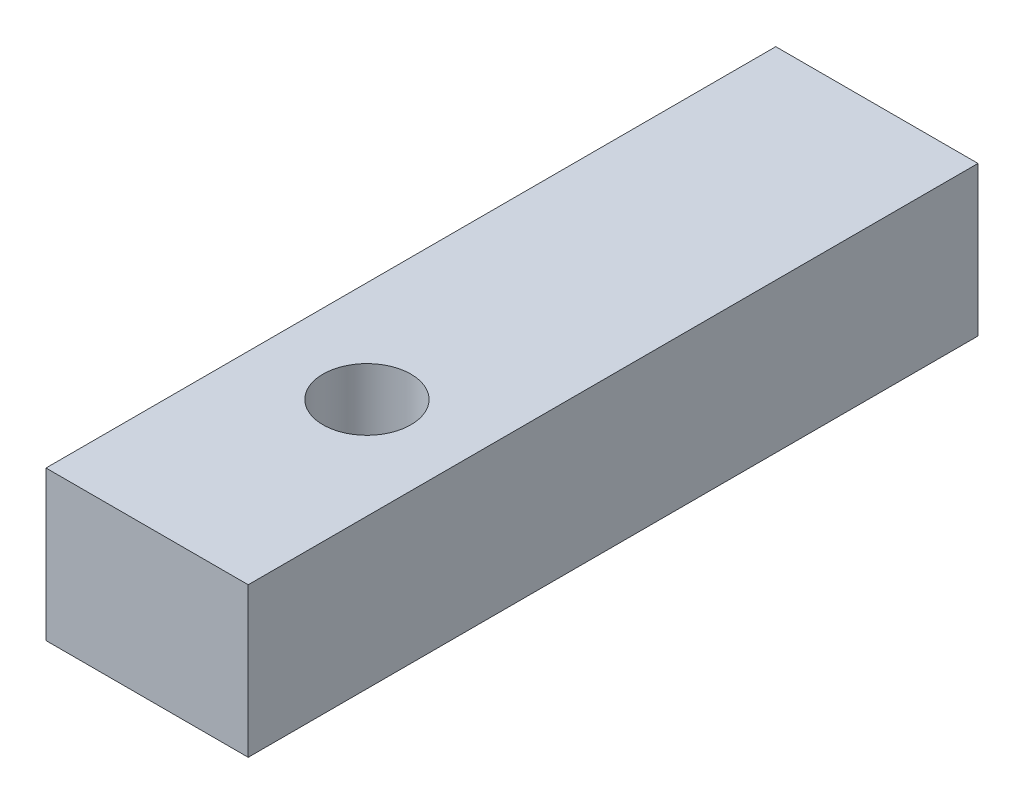
ISO-10303-21;
HEADER;
FILE_DESCRIPTION(('STEP AP214'),'2;1');
FILE_NAME('part.step','',(''),(''),'','','');
FILE_SCHEMA(('AUTOMOTIVE_DESIGN { 1 0 10303 214 1 1 1 1 }'));
ENDSEC;
DATA;
#1=APPLICATION_CONTEXT('core data for automotive mechanical design processes');
#2=APPLICATION_PROTOCOL_DEFINITION('international standard','automotive_design',2000,#1);
#3=PRODUCT_CONTEXT('',#1,'mechanical');
#4=PRODUCT('Part','Part','',(#3));
#5=PRODUCT_RELATED_PRODUCT_CATEGORY('part','',(#4));
#6=PRODUCT_DEFINITION_FORMATION('','',#4);
#7=PRODUCT_DEFINITION_CONTEXT('part definition',#1,'design');
#8=PRODUCT_DEFINITION('design','',#6,#7);
#9=PRODUCT_DEFINITION_SHAPE('','',#8);
#10=(LENGTH_UNIT() NAMED_UNIT(*) SI_UNIT(.MILLI.,.METRE.));
#11=(NAMED_UNIT(*) PLANE_ANGLE_UNIT() SI_UNIT($,.RADIAN.));
#12=(NAMED_UNIT(*) SI_UNIT($,.STERADIAN.) SOLID_ANGLE_UNIT());
#13=UNCERTAINTY_MEASURE_WITH_UNIT(LENGTH_MEASURE(1.E-05),#10,'distance_accuracy_value','');
#14=(GEOMETRIC_REPRESENTATION_CONTEXT(3) GLOBAL_UNCERTAINTY_ASSIGNED_CONTEXT((#13)) GLOBAL_UNIT_ASSIGNED_CONTEXT((#10,
#11,#12)) REPRESENTATION_CONTEXT('',''));
#15=CARTESIAN_POINT('',(0.,0.,0.));
#16=DIRECTION('',(0.,0.,1.));
#17=DIRECTION('',(1.,0.,0.));
#18=AXIS2_PLACEMENT_3D('',#15,#16,#17);
#19=CARTESIAN_POINT('',(-9.37031473424691,-28.3971041858876,7.99875547561629));
#20=DIRECTION('',(0.,-1.,0.));
#21=DIRECTION('',(0.,0.,-1.));
#22=AXIS2_PLACEMENT_3D('',#19,#20,#21);
#23=PLANE('',#22);
#24=CARTESIAN_POINT('',(-40.4,-28.3971041858876,13.9987554756163));
#25=DIRECTION('',(0.,-1.,0.));
#26=DIRECTION('',(0.,0.,-1.));
#27=AXIS2_PLACEMENT_3D('',#24,#25,#26);
#28=CIRCLE('',#27,5.);
#29=CARTESIAN_POINT('',(-40.4,-28.3971041858876,8.9987554756163));
#30=VERTEX_POINT('',#29);
#31=EDGE_CURVE('E20',#30,#30,#28,.F.);
#32=ORIENTED_EDGE('',*,*,#31,.T.);
#33=EDGE_LOOP('',(#32));
#34=FACE_BOUND('',#33,.T.);
#35=DIRECTION('',(0.,0.,1.));
#36=VECTOR('',#35,1.);
#37=CARTESIAN_POINT('',(-28.9,-28.3971041858876,39.));
#38=LINE('',#37,#36);
#39=CARTESIAN_POINT('',(-28.9,-28.3971041858876,-44.));
#40=VERTEX_POINT('',#39);
#41=CARTESIAN_POINT('',(-28.9,-28.3971041858876,39.));
#42=VERTEX_POINT('',#41);
#43=EDGE_CURVE('E60',#40,#42,#38,.T.);
#44=ORIENTED_EDGE('',*,*,#43,.T.);
#45=DIRECTION('',(-1.,0.,0.));
#46=VECTOR('',#45,1.);
#47=CARTESIAN_POINT('',(-51.9,-28.3971041858876,39.));
#48=LINE('',#47,#46);
#49=CARTESIAN_POINT('',(-51.9,-28.3971041858876,39.));
#50=VERTEX_POINT('',#49);
#51=EDGE_CURVE('E78',#42,#50,#48,.T.);
#52=ORIENTED_EDGE('',*,*,#51,.T.);
#53=DIRECTION('',(0.,0.,-1.));
#54=VECTOR('',#53,1.);
#55=CARTESIAN_POINT('',(-51.9,-28.3971041858876,-44.));
#56=LINE('',#55,#54);
#57=CARTESIAN_POINT('',(-51.9,-28.3971041858876,-44.));
#58=VERTEX_POINT('',#57);
#59=EDGE_CURVE('E75',#50,#58,#56,.T.);
#60=ORIENTED_EDGE('',*,*,#59,.T.);
#61=DIRECTION('',(1.,0.,0.));
#62=VECTOR('',#61,1.);
#63=CARTESIAN_POINT('',(-28.9,-28.3971041858876,-44.));
#64=LINE('',#63,#62);
#65=EDGE_CURVE('E65',#58,#40,#64,.T.);
#66=ORIENTED_EDGE('',*,*,#65,.T.);
#67=EDGE_LOOP('',(#44,#52,#60,#66));
#68=FACE_BOUND('',#67,.T.);
#69=ADVANCED_FACE('F17',(#34,#68),#23,.T.);
#70=CARTESIAN_POINT('',(-51.9,-28.3971041858876,-44.));
#71=DIRECTION('',(1.,0.,0.));
#72=DIRECTION('',(0.,0.,-1.));
#73=AXIS2_PLACEMENT_3D('',#70,#71,#72);
#74=PLANE('',#73);
#75=DIRECTION('',(0.,0.,-1.));
#76=VECTOR('',#75,1.);
#77=CARTESIAN_POINT('',(-51.9,-11.3971041858876,7.99875547561629));
#78=LINE('',#77,#76);
#79=CARTESIAN_POINT('',(-51.9,-11.3971041858876,39.));
#80=VERTEX_POINT('',#79);
#81=CARTESIAN_POINT('',(-51.9,-11.3971041858876,-44.));
#82=VERTEX_POINT('',#81);
#83=EDGE_CURVE('E86',#80,#82,#78,.T.);
#84=ORIENTED_EDGE('',*,*,#83,.T.);
#85=DIRECTION('',(0.,1.,0.));
#86=VECTOR('',#85,1.);
#87=CARTESIAN_POINT('',(-51.9,-28.3971041858876,-44.));
#88=LINE('',#87,#86);
#89=EDGE_CURVE('E70',#82,#58,#88,.F.);
#90=ORIENTED_EDGE('',*,*,#89,.T.);
#91=ORIENTED_EDGE('',*,*,#59,.F.);
#92=DIRECTION('',(0.,1.,0.));
#93=VECTOR('',#92,1.);
#94=CARTESIAN_POINT('',(-51.9,-28.3971041858876,39.));
#95=LINE('',#94,#93);
#96=EDGE_CURVE('E98',#50,#80,#95,.T.);
#97=ORIENTED_EDGE('',*,*,#96,.T.);
#98=EDGE_LOOP('',(#84,#90,#91,#97));
#99=FACE_BOUND('',#98,.T.);
#100=ADVANCED_FACE('F85',(#99),#74,.F.);
#101=CARTESIAN_POINT('',(-28.9,-28.3971041858876,-44.));
#102=DIRECTION('',(0.,0.,1.));
#103=DIRECTION('',(1.,0.,0.));
#104=AXIS2_PLACEMENT_3D('',#101,#102,#103);
#105=PLANE('',#104);
#106=DIRECTION('',(1.,0.,0.));
#107=VECTOR('',#106,1.);
#108=CARTESIAN_POINT('',(-9.37031473424691,-11.3971041858876,-44.));
#109=LINE('',#108,#107);
#110=CARTESIAN_POINT('',(-28.9,-11.3971041858876,-44.));
#111=VERTEX_POINT('',#110);
#112=EDGE_CURVE('E105',#82,#111,#109,.T.);
#113=ORIENTED_EDGE('',*,*,#112,.T.);
#114=DIRECTION('',(0.,1.,0.));
#115=VECTOR('',#114,1.);
#116=CARTESIAN_POINT('',(-28.9,-28.3971041858876,-44.));
#117=LINE('',#116,#115);
#118=EDGE_CURVE('E72',#111,#40,#117,.F.);
#119=ORIENTED_EDGE('',*,*,#118,.T.);
#120=ORIENTED_EDGE('',*,*,#65,.F.);
#121=ORIENTED_EDGE('',*,*,#89,.F.);
#122=EDGE_LOOP('',(#113,#119,#120,#121));
#123=FACE_BOUND('',#122,.T.);
#124=ADVANCED_FACE('F68',(#123),#105,.F.);
#125=CARTESIAN_POINT('',(-28.9,-28.3971041858876,39.));
#126=DIRECTION('',(-1.,0.,0.));
#127=DIRECTION('',(0.,0.,1.));
#128=AXIS2_PLACEMENT_3D('',#125,#126,#127);
#129=PLANE('',#128);
#130=DIRECTION('',(0.,0.,-1.));
#131=VECTOR('',#130,1.);
#132=CARTESIAN_POINT('',(-28.9,-11.3971041858876,7.99875547561629));
#133=LINE('',#132,#131);
#134=CARTESIAN_POINT('',(-28.9,-11.3971041858876,39.));
#135=VERTEX_POINT('',#134);
#136=EDGE_CURVE('E107',#111,#135,#133,.F.);
#137=ORIENTED_EDGE('',*,*,#136,.T.);
#138=DIRECTION('',(0.,1.,0.));
#139=VECTOR('',#138,1.);
#140=CARTESIAN_POINT('',(-28.9,-28.3971041858876,39.));
#141=LINE('',#140,#139);
#142=EDGE_CURVE('E38',#135,#42,#141,.F.);
#143=ORIENTED_EDGE('',*,*,#142,.T.);
#144=ORIENTED_EDGE('',*,*,#43,.F.);
#145=ORIENTED_EDGE('',*,*,#118,.F.);
#146=EDGE_LOOP('',(#137,#143,#144,#145));
#147=FACE_BOUND('',#146,.T.);
#148=ADVANCED_FACE('F116',(#147),#129,.F.);
#149=CARTESIAN_POINT('',(-51.9,-28.3971041858876,39.));
#150=DIRECTION('',(0.,0.,-1.));
#151=DIRECTION('',(-1.,0.,0.));
#152=AXIS2_PLACEMENT_3D('',#149,#150,#151);
#153=PLANE('',#152);
#154=DIRECTION('',(1.,0.,0.));
#155=VECTOR('',#154,1.);
#156=CARTESIAN_POINT('',(-9.37031473424691,-11.3971041858876,39.));
#157=LINE('',#156,#155);
#158=EDGE_CURVE('E27',#135,#80,#157,.F.);
#159=ORIENTED_EDGE('',*,*,#158,.T.);
#160=ORIENTED_EDGE('',*,*,#96,.F.);
#161=ORIENTED_EDGE('',*,*,#51,.F.);
#162=ORIENTED_EDGE('',*,*,#142,.F.);
#163=EDGE_LOOP('',(#159,#160,#161,#162));
#164=FACE_BOUND('',#163,.T.);
#165=ADVANCED_FACE('F112',(#164),#153,.F.);
#166=CARTESIAN_POINT('',(-40.4,-28.3971041858876,13.9987554756163));
#167=DIRECTION('',(0.,-1.,0.));
#168=DIRECTION('',(0.,0.,-1.));
#169=AXIS2_PLACEMENT_3D('',#166,#167,#168);
#170=CYLINDRICAL_SURFACE('',#169,5.);
#171=CARTESIAN_POINT('',(-40.4,-11.3971041858876,13.9987554756163));
#172=DIRECTION('',(0.,-1.,0.));
#173=DIRECTION('',(0.,0.,-1.));
#174=AXIS2_PLACEMENT_3D('',#171,#172,#173);
#175=CIRCLE('',#174,5.);
#176=CARTESIAN_POINT('',(-40.4,-11.3971041858876,8.9987554756163));
#177=VERTEX_POINT('',#176);
#178=EDGE_CURVE('E11',#177,#177,#175,.F.);
#179=ORIENTED_EDGE('',*,*,#178,.T.);
#180=EDGE_LOOP('',(#179));
#181=FACE_BOUND('',#180,.T.);
#182=ORIENTED_EDGE('',*,*,#31,.F.);
#183=EDGE_LOOP('',(#182));
#184=FACE_BOUND('',#183,.T.);
#185=ADVANCED_FACE('F124',(#181,#184),#170,.F.);
#186=CARTESIAN_POINT('',(-9.37031473424691,-11.3971041858876,7.99875547561629));
#187=DIRECTION('',(0.,-1.,0.));
#188=DIRECTION('',(0.,0.,-1.));
#189=AXIS2_PLACEMENT_3D('',#186,#187,#188);
#190=PLANE('',#189);
#191=ORIENTED_EDGE('',*,*,#178,.F.);
#192=EDGE_LOOP('',(#191));
#193=FACE_BOUND('',#192,.T.);
#194=ORIENTED_EDGE('',*,*,#136,.F.);
#195=ORIENTED_EDGE('',*,*,#112,.F.);
#196=ORIENTED_EDGE('',*,*,#83,.F.);
#197=ORIENTED_EDGE('',*,*,#158,.F.);
#198=EDGE_LOOP('',(#194,#195,#196,#197));
#199=FACE_BOUND('',#198,.T.);
#200=ADVANCED_FACE('F115',(#193,#199),#190,.F.);
#201=CLOSED_SHELL('',(#69,#100,#124,#148,#165,#185,#200));
#202=MANIFOLD_SOLID_BREP('B1',#201);
#203=ADVANCED_BREP_SHAPE_REPRESENTATION('',(#18,#202),#14);
#204=SHAPE_DEFINITION_REPRESENTATION(#9,#203);
ENDSEC;
END-ISO-10303-21;
